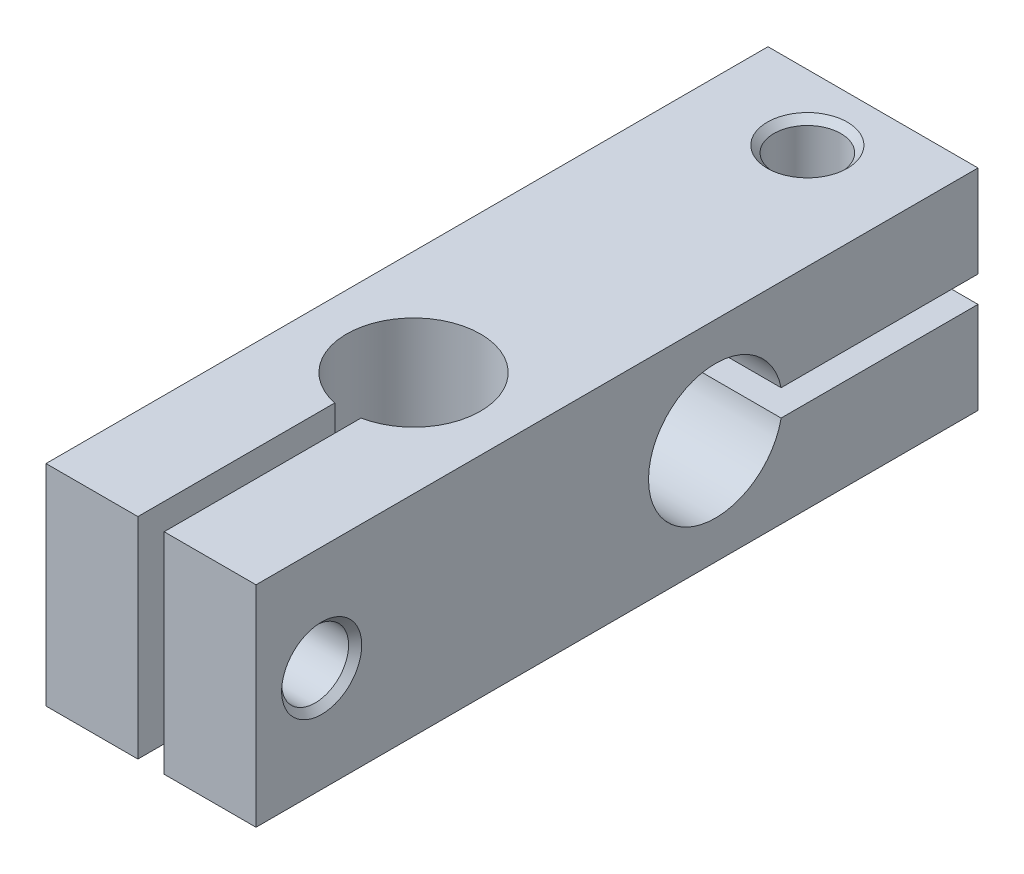
ISO-10303-21;
HEADER;
FILE_DESCRIPTION(('STEP AP214'),'2;1');
FILE_NAME('part.step','',(''),(''),'','','');
FILE_SCHEMA(('AUTOMOTIVE_DESIGN { 1 0 10303 214 1 1 1 1 }'));
ENDSEC;
DATA;
#1=APPLICATION_CONTEXT('core data for automotive mechanical design processes');
#2=APPLICATION_PROTOCOL_DEFINITION('international standard','automotive_design',2000,#1);
#3=PRODUCT_CONTEXT('',#1,'mechanical');
#4=PRODUCT('Part','Part','',(#3));
#5=PRODUCT_RELATED_PRODUCT_CATEGORY('part','',(#4));
#6=PRODUCT_DEFINITION_FORMATION('','',#4);
#7=PRODUCT_DEFINITION_CONTEXT('part definition',#1,'design');
#8=PRODUCT_DEFINITION('design','',#6,#7);
#9=PRODUCT_DEFINITION_SHAPE('','',#8);
#10=(LENGTH_UNIT() NAMED_UNIT(*) SI_UNIT(.MILLI.,.METRE.));
#11=(NAMED_UNIT(*) PLANE_ANGLE_UNIT() SI_UNIT($,.RADIAN.));
#12=(NAMED_UNIT(*) SI_UNIT($,.STERADIAN.) SOLID_ANGLE_UNIT());
#13=UNCERTAINTY_MEASURE_WITH_UNIT(LENGTH_MEASURE(1.E-05),#10,'distance_accuracy_value','');
#14=(GEOMETRIC_REPRESENTATION_CONTEXT(3) GLOBAL_UNCERTAINTY_ASSIGNED_CONTEXT((#13)) GLOBAL_UNIT_ASSIGNED_CONTEXT((#10,
#11,#12)) REPRESENTATION_CONTEXT('',''));
#15=CARTESIAN_POINT('',(0.,0.,0.));
#16=DIRECTION('',(0.,0.,1.));
#17=DIRECTION('',(1.,0.,0.));
#18=AXIS2_PLACEMENT_3D('',#15,#16,#17);
#19=CARTESIAN_POINT('',(0.,0.,0.));
#20=DIRECTION('',(0.,0.,1.));
#21=DIRECTION('',(1.,0.,0.));
#22=AXIS2_PLACEMENT_3D('',#19,#20,#21);
#23=PLANE('',#22);
#24=DIRECTION('',(0.,1.,0.));
#25=VECTOR('',#24,1.);
#26=CARTESIAN_POINT('',(8.,-8.,0.));
#27=LINE('',#26,#25);
#28=CARTESIAN_POINT('',(8.,1.,0.));
#29=VERTEX_POINT('',#28);
#30=CARTESIAN_POINT('',(8.,8.,0.));
#31=VERTEX_POINT('',#30);
#32=EDGE_CURVE('E211',#29,#31,#27,.T.);
#33=ORIENTED_EDGE('',*,*,#32,.F.);
#34=DIRECTION('',(-1.,0.,0.));
#35=VECTOR('',#34,1.);
#36=CARTESIAN_POINT('',(8.,1.,0.));
#37=LINE('',#36,#35);
#38=CARTESIAN_POINT('',(-8.,1.,0.));
#39=VERTEX_POINT('',#38);
#40=EDGE_CURVE('E148',#29,#39,#37,.T.);
#41=ORIENTED_EDGE('',*,*,#40,.T.);
#42=DIRECTION('',(0.,-1.,0.));
#43=VECTOR('',#42,1.);
#44=CARTESIAN_POINT('',(-8.,-8.,0.));
#45=LINE('',#44,#43);
#46=CARTESIAN_POINT('',(-8.,8.,0.));
#47=VERTEX_POINT('',#46);
#48=EDGE_CURVE('E206',#47,#39,#45,.T.);
#49=ORIENTED_EDGE('',*,*,#48,.F.);
#50=DIRECTION('',(-1.,0.,0.));
#51=VECTOR('',#50,1.);
#52=CARTESIAN_POINT('',(8.,8.,0.));
#53=LINE('',#52,#51);
#54=EDGE_CURVE('E195',#31,#47,#53,.T.);
#55=ORIENTED_EDGE('',*,*,#54,.F.);
#56=EDGE_LOOP('',(#33,#41,#49,#55));
#57=FACE_BOUND('',#56,.T.);
#58=ADVANCED_FACE('F36',(#57),#23,.F.);
#59=CARTESIAN_POINT('',(0.,0.,55.));
#60=DIRECTION('',(0.,0.,1.));
#61=DIRECTION('',(1.,0.,0.));
#62=AXIS2_PLACEMENT_3D('',#59,#60,#61);
#63=PLANE('',#62);
#64=DIRECTION('',(1.,0.,0.));
#65=VECTOR('',#64,1.);
#66=CARTESIAN_POINT('',(8.,-8.,55.));
#67=LINE('',#66,#65);
#68=CARTESIAN_POINT('',(-8.,-8.,55.));
#69=VERTEX_POINT('',#68);
#70=CARTESIAN_POINT('',(-0.999999999999994,-8.,55.));
#71=VERTEX_POINT('',#70);
#72=EDGE_CURVE('E196',#69,#71,#67,.T.);
#73=ORIENTED_EDGE('',*,*,#72,.T.);
#74=DIRECTION('',(0.,1.,0.));
#75=VECTOR('',#74,1.);
#76=CARTESIAN_POINT('',(-0.999999999999994,-8.,55.));
#77=LINE('',#76,#75);
#78=CARTESIAN_POINT('',(-0.999999999999997,8.,55.));
#79=VERTEX_POINT('',#78);
#80=EDGE_CURVE('E180',#71,#79,#77,.T.);
#81=ORIENTED_EDGE('',*,*,#80,.T.);
#82=DIRECTION('',(-1.,0.,0.));
#83=VECTOR('',#82,1.);
#84=CARTESIAN_POINT('',(8.,8.,55.));
#85=LINE('',#84,#83);
#86=CARTESIAN_POINT('',(-8.,8.,55.));
#87=VERTEX_POINT('',#86);
#88=EDGE_CURVE('E201',#79,#87,#85,.T.);
#89=ORIENTED_EDGE('',*,*,#88,.T.);
#90=DIRECTION('',(0.,-1.,0.));
#91=VECTOR('',#90,1.);
#92=CARTESIAN_POINT('',(-8.,-8.,55.));
#93=LINE('',#92,#91);
#94=EDGE_CURVE('E191',#87,#69,#93,.T.);
#95=ORIENTED_EDGE('',*,*,#94,.T.);
#96=EDGE_LOOP('',(#73,#81,#89,#95));
#97=FACE_BOUND('',#96,.T.);
#98=ADVANCED_FACE('F239',(#97),#63,.T.);
#99=CARTESIAN_POINT('',(-8.,-8.,55.));
#100=DIRECTION('',(1.,0.,0.));
#101=DIRECTION('',(0.,0.,-1.));
#102=AXIS2_PLACEMENT_3D('',#99,#100,#101);
#103=PLANE('',#102);
#104=CARTESIAN_POINT('',(-8.,0.,50.));
#105=DIRECTION('',(-1.,0.,0.));
#106=DIRECTION('',(0.,0.,1.));
#107=AXIS2_PLACEMENT_3D('',#104,#105,#106);
#108=CIRCLE('',#107,2.1);
#109=CARTESIAN_POINT('',(-8.,0.,52.1));
#110=VERTEX_POINT('',#109);
#111=EDGE_CURVE('E160',#110,#110,#108,.T.);
#112=ORIENTED_EDGE('',*,*,#111,.F.);
#113=EDGE_LOOP('',(#112));
#114=FACE_BOUND('',#113,.T.);
#115=DIRECTION('',(0.,0.,-1.));
#116=VECTOR('',#115,1.);
#117=CARTESIAN_POINT('',(-8.,1.,0.));
#118=LINE('',#117,#116);
#119=CARTESIAN_POINT('',(-8.,0.999999999999999,14.99900009998));
#120=VERTEX_POINT('',#119);
#121=EDGE_CURVE('E140',#120,#39,#118,.T.);
#122=ORIENTED_EDGE('',*,*,#121,.F.);
#123=CARTESIAN_POINT('',(-8.,0.,20.));
#124=DIRECTION('',(-1.,0.,0.));
#125=DIRECTION('',(0.,0.,1.));
#126=AXIS2_PLACEMENT_3D('',#123,#124,#125);
#127=CIRCLE('',#126,5.09999999999999);
#128=CARTESIAN_POINT('',(-8.,-1.,14.99900009998));
#129=VERTEX_POINT('',#128);
#130=EDGE_CURVE('E132',#129,#120,#127,.T.);
#131=ORIENTED_EDGE('',*,*,#130,.F.);
#132=DIRECTION('',(0.,0.,1.));
#133=VECTOR('',#132,1.);
#134=CARTESIAN_POINT('',(-8.,-1.,0.));
#135=LINE('',#134,#133);
#136=CARTESIAN_POINT('',(-8.,-1.,0.));
#137=VERTEX_POINT('',#136);
#138=EDGE_CURVE('E131',#137,#129,#135,.T.);
#139=ORIENTED_EDGE('',*,*,#138,.F.);
#140=CARTESIAN_POINT('',(-8.,-8.,0.));
#141=VERTEX_POINT('',#140);
#142=EDGE_CURVE('E188',#137,#141,#45,.T.);
#143=ORIENTED_EDGE('',*,*,#142,.T.);
#144=DIRECTION('',(0.,0.,-1.));
#145=VECTOR('',#144,1.);
#146=CARTESIAN_POINT('',(-8.,-8.,55.));
#147=LINE('',#146,#145);
#148=EDGE_CURVE('E221',#69,#141,#147,.T.);
#149=ORIENTED_EDGE('',*,*,#148,.F.);
#150=ORIENTED_EDGE('',*,*,#94,.F.);
#151=DIRECTION('',(0.,0.,-1.));
#152=VECTOR('',#151,1.);
#153=CARTESIAN_POINT('',(-8.,8.,55.));
#154=LINE('',#153,#152);
#155=EDGE_CURVE('E205',#87,#47,#154,.T.);
#156=ORIENTED_EDGE('',*,*,#155,.T.);
#157=ORIENTED_EDGE('',*,*,#48,.T.);
#158=EDGE_LOOP('',(#122,#131,#139,#143,#149,#150,#156,#157));
#159=FACE_BOUND('',#158,.T.);
#160=ADVANCED_FACE('F38',(#114,#159),#103,.F.);
#161=CARTESIAN_POINT('',(8.,-8.,55.));
#162=DIRECTION('',(0.,1.,0.));
#163=DIRECTION('',(-1.,0.,0.));
#164=AXIS2_PLACEMENT_3D('',#161,#162,#163);
#165=PLANE('',#164);
#166=CARTESIAN_POINT('',(0.,-8.,5.));
#167=DIRECTION('',(0.,-1.,0.));
#168=DIRECTION('',(0.,0.,-1.));
#169=AXIS2_PLACEMENT_3D('',#166,#167,#168);
#170=CIRCLE('',#169,2.09999999999999);
#171=CARTESIAN_POINT('',(0.,-8.,2.90000000000001));
#172=VERTEX_POINT('',#171);
#173=EDGE_CURVE('E268',#172,#172,#170,.T.);
#174=ORIENTED_EDGE('',*,*,#173,.F.);
#175=EDGE_LOOP('',(#174));
#176=FACE_BOUND('',#175,.T.);
#177=DIRECTION('',(0.,0.,-1.));
#178=VECTOR('',#177,1.);
#179=CARTESIAN_POINT('',(1.00000000000001,-8.,0.));
#180=LINE('',#179,#178);
#181=CARTESIAN_POINT('',(1.00000000000001,-8.,55.));
#182=VERTEX_POINT('',#181);
#183=CARTESIAN_POINT('',(1.00000000000001,-8.,40.00099990002));
#184=VERTEX_POINT('',#183);
#185=EDGE_CURVE('E176',#182,#184,#180,.T.);
#186=ORIENTED_EDGE('',*,*,#185,.T.);
#187=CARTESIAN_POINT('',(0.,-8.,35.));
#188=DIRECTION('',(0.,1.,0.));
#189=DIRECTION('',(0.,0.,1.));
#190=AXIS2_PLACEMENT_3D('',#187,#188,#189);
#191=CIRCLE('',#190,5.1);
#192=CARTESIAN_POINT('',(-0.999999999999998,-8.,40.00099990002));
#193=VERTEX_POINT('',#192);
#194=EDGE_CURVE('E154',#184,#193,#191,.T.);
#195=ORIENTED_EDGE('',*,*,#194,.T.);
#196=DIRECTION('',(0.,0.,-1.));
#197=VECTOR('',#196,1.);
#198=CARTESIAN_POINT('',(-1.00000000000001,-8.,0.));
#199=LINE('',#198,#197);
#200=EDGE_CURVE('E173',#71,#193,#199,.T.);
#201=ORIENTED_EDGE('',*,*,#200,.F.);
#202=ORIENTED_EDGE('',*,*,#72,.F.);
#203=ORIENTED_EDGE('',*,*,#148,.T.);
#204=DIRECTION('',(1.,0.,0.));
#205=VECTOR('',#204,1.);
#206=CARTESIAN_POINT('',(8.,-8.,0.));
#207=LINE('',#206,#205);
#208=CARTESIAN_POINT('',(8.,-8.,0.));
#209=VERTEX_POINT('',#208);
#210=EDGE_CURVE('E209',#141,#209,#207,.T.);
#211=ORIENTED_EDGE('',*,*,#210,.T.);
#212=DIRECTION('',(0.,0.,-1.));
#213=VECTOR('',#212,1.);
#214=CARTESIAN_POINT('',(8.,-8.,55.));
#215=LINE('',#214,#213);
#216=CARTESIAN_POINT('',(8.,-8.,55.));
#217=VERTEX_POINT('',#216);
#218=EDGE_CURVE('E219',#217,#209,#215,.T.);
#219=ORIENTED_EDGE('',*,*,#218,.F.);
#220=EDGE_CURVE('E194',#182,#217,#67,.T.);
#221=ORIENTED_EDGE('',*,*,#220,.F.);
#222=EDGE_LOOP('',(#186,#195,#201,#202,#203,#211,#219,#221));
#223=FACE_BOUND('',#222,.T.);
#224=ADVANCED_FACE('F233',(#176,#223),#165,.F.);
#225=CARTESIAN_POINT('',(8.,-8.,55.));
#226=DIRECTION('',(-1.,0.,0.));
#227=DIRECTION('',(0.,0.,1.));
#228=AXIS2_PLACEMENT_3D('',#225,#226,#227);
#229=PLANE('',#228);
#230=CARTESIAN_POINT('',(8.,0.,50.));
#231=DIRECTION('',(1.,0.,0.));
#232=DIRECTION('',(0.,0.,-1.));
#233=AXIS2_PLACEMENT_3D('',#230,#231,#232);
#234=CIRCLE('',#233,3.05);
#235=CARTESIAN_POINT('',(8.,0.,46.95));
#236=VERTEX_POINT('',#235);
#237=EDGE_CURVE('E166',#236,#236,#234,.T.);
#238=ORIENTED_EDGE('',*,*,#237,.F.);
#239=EDGE_LOOP('',(#238));
#240=FACE_BOUND('',#239,.T.);
#241=DIRECTION('',(0.,0.,1.));
#242=VECTOR('',#241,1.);
#243=CARTESIAN_POINT('',(8.,-1.,0.));
#244=LINE('',#243,#242);
#245=CARTESIAN_POINT('',(8.,-1.,0.));
#246=VERTEX_POINT('',#245);
#247=CARTESIAN_POINT('',(8.,-1.,14.99900009998));
#248=VERTEX_POINT('',#247);
#249=EDGE_CURVE('E59',#246,#248,#244,.T.);
#250=ORIENTED_EDGE('',*,*,#249,.T.);
#251=CARTESIAN_POINT('',(8.,0.,20.));
#252=DIRECTION('',(-1.,0.,0.));
#253=DIRECTION('',(0.,0.,1.));
#254=AXIS2_PLACEMENT_3D('',#251,#252,#253);
#255=CIRCLE('',#254,5.09999999999999);
#256=CARTESIAN_POINT('',(8.,1.,14.99900009998));
#257=VERTEX_POINT('',#256);
#258=EDGE_CURVE('E11',#248,#257,#255,.T.);
#259=ORIENTED_EDGE('',*,*,#258,.T.);
#260=DIRECTION('',(0.,0.,-1.));
#261=VECTOR('',#260,1.);
#262=CARTESIAN_POINT('',(8.,1.,0.));
#263=LINE('',#262,#261);
#264=EDGE_CURVE('E139',#257,#29,#263,.T.);
#265=ORIENTED_EDGE('',*,*,#264,.T.);
#266=ORIENTED_EDGE('',*,*,#32,.T.);
#267=DIRECTION('',(0.,0.,-1.));
#268=VECTOR('',#267,1.);
#269=CARTESIAN_POINT('',(8.,8.,55.));
#270=LINE('',#269,#268);
#271=CARTESIAN_POINT('',(8.,8.,55.));
#272=VERTEX_POINT('',#271);
#273=EDGE_CURVE('E216',#272,#31,#270,.T.);
#274=ORIENTED_EDGE('',*,*,#273,.F.);
#275=DIRECTION('',(0.,1.,0.));
#276=VECTOR('',#275,1.);
#277=CARTESIAN_POINT('',(8.,-8.,55.));
#278=LINE('',#277,#276);
#279=EDGE_CURVE('E199',#217,#272,#278,.T.);
#280=ORIENTED_EDGE('',*,*,#279,.F.);
#281=ORIENTED_EDGE('',*,*,#218,.T.);
#282=EDGE_CURVE('E138',#209,#246,#27,.T.);
#283=ORIENTED_EDGE('',*,*,#282,.T.);
#284=EDGE_LOOP('',(#250,#259,#265,#266,#274,#280,#281,#283));
#285=FACE_BOUND('',#284,.T.);
#286=ADVANCED_FACE('F135',(#240,#285),#229,.F.);
#287=CARTESIAN_POINT('',(8.,8.,55.));
#288=DIRECTION('',(0.,-1.,0.));
#289=DIRECTION('',(1.,0.,0.));
#290=AXIS2_PLACEMENT_3D('',#287,#288,#289);
#291=PLANE('',#290);
#292=CARTESIAN_POINT('',(0.,8.,5.));
#293=DIRECTION('',(0.,1.,0.));
#294=DIRECTION('',(0.,0.,1.));
#295=AXIS2_PLACEMENT_3D('',#292,#293,#294);
#296=CIRCLE('',#295,3.05);
#297=CARTESIAN_POINT('',(0.,8.,8.05));
#298=VERTEX_POINT('',#297);
#299=EDGE_CURVE('E262',#298,#298,#296,.T.);
#300=ORIENTED_EDGE('',*,*,#299,.F.);
#301=EDGE_LOOP('',(#300));
#302=FACE_BOUND('',#301,.T.);
#303=DIRECTION('',(0.,0.,-1.));
#304=VECTOR('',#303,1.);
#305=CARTESIAN_POINT('',(-1.00000000000001,8.,0.));
#306=LINE('',#305,#304);
#307=CARTESIAN_POINT('',(-0.999999999999997,8.,40.00099990002));
#308=VERTEX_POINT('',#307);
#309=EDGE_CURVE('E181',#79,#308,#306,.T.);
#310=ORIENTED_EDGE('',*,*,#309,.T.);
#311=CARTESIAN_POINT('',(0.,8.,35.));
#312=DIRECTION('',(0.,1.,0.));
#313=DIRECTION('',(0.,0.,1.));
#314=AXIS2_PLACEMENT_3D('',#311,#312,#313);
#315=CIRCLE('',#314,5.09999999999999);
#316=CARTESIAN_POINT('',(1.00000000000001,8.,40.00099990002));
#317=VERTEX_POINT('',#316);
#318=EDGE_CURVE('E151',#317,#308,#315,.T.);
#319=ORIENTED_EDGE('',*,*,#318,.F.);
#320=DIRECTION('',(0.,0.,-1.));
#321=VECTOR('',#320,1.);
#322=CARTESIAN_POINT('',(1.00000000000001,8.,0.));
#323=LINE('',#322,#321);
#324=CARTESIAN_POINT('',(1.00000000000001,8.,55.));
#325=VERTEX_POINT('',#324);
#326=EDGE_CURVE('E177',#325,#317,#323,.T.);
#327=ORIENTED_EDGE('',*,*,#326,.F.);
#328=EDGE_CURVE('E202',#272,#325,#85,.T.);
#329=ORIENTED_EDGE('',*,*,#328,.F.);
#330=ORIENTED_EDGE('',*,*,#273,.T.);
#331=ORIENTED_EDGE('',*,*,#54,.T.);
#332=ORIENTED_EDGE('',*,*,#155,.F.);
#333=ORIENTED_EDGE('',*,*,#88,.F.);
#334=EDGE_LOOP('',(#310,#319,#327,#329,#330,#331,#332,#333));
#335=FACE_BOUND('',#334,.T.);
#336=ADVANCED_FACE('F242',(#302,#335),#291,.F.);
#337=DIRECTION('',(0.,1.,0.));
#338=VECTOR('',#337,1.);
#339=CARTESIAN_POINT('',(1.00000000000001,-8.,55.));
#340=LINE('',#339,#338);
#341=EDGE_CURVE('E186',#182,#325,#340,.T.);
#342=ORIENTED_EDGE('',*,*,#341,.F.);
#343=ORIENTED_EDGE('',*,*,#220,.T.);
#344=ORIENTED_EDGE('',*,*,#279,.T.);
#345=ORIENTED_EDGE('',*,*,#328,.T.);
#346=EDGE_LOOP('',(#342,#343,#344,#345));
#347=FACE_BOUND('',#346,.T.);
#348=ADVANCED_FACE('F290',(#347),#63,.T.);
#349=ORIENTED_EDGE('',*,*,#142,.F.);
#350=DIRECTION('',(-1.,0.,0.));
#351=VECTOR('',#350,1.);
#352=CARTESIAN_POINT('',(8.,-1.,0.));
#353=LINE('',#352,#351);
#354=EDGE_CURVE('E142',#246,#137,#353,.T.);
#355=ORIENTED_EDGE('',*,*,#354,.F.);
#356=ORIENTED_EDGE('',*,*,#282,.F.);
#357=ORIENTED_EDGE('',*,*,#210,.F.);
#358=EDGE_LOOP('',(#349,#355,#356,#357));
#359=FACE_BOUND('',#358,.T.);
#360=ADVANCED_FACE('F255',(#359),#23,.F.);
#361=CARTESIAN_POINT('',(1.00000000000001,-8.,0.));
#362=DIRECTION('',(1.,0.,0.));
#363=DIRECTION('',(0.,1.,0.));
#364=AXIS2_PLACEMENT_3D('',#361,#362,#363);
#365=PLANE('',#364);
#366=CARTESIAN_POINT('',(1.00000000000001,0.,50.));
#367=DIRECTION('',(1.,0.,0.));
#368=DIRECTION('',(0.,1.,0.));
#369=AXIS2_PLACEMENT_3D('',#366,#367,#368);
#370=CIRCLE('',#369,2.54999999999999);
#371=CARTESIAN_POINT('',(1.00000000000001,2.54999999999999,50.));
#372=VERTEX_POINT('',#371);
#373=EDGE_CURVE('E172',#372,#372,#370,.T.);
#374=ORIENTED_EDGE('',*,*,#373,.T.);
#375=EDGE_LOOP('',(#374));
#376=FACE_BOUND('',#375,.T.);
#377=ORIENTED_EDGE('',*,*,#326,.T.);
#378=DIRECTION('',(0.,1.,0.));
#379=VECTOR('',#378,1.);
#380=CARTESIAN_POINT('',(1.00000000000001,8.,40.00099990002));
#381=LINE('',#380,#379);
#382=EDGE_CURVE('E157',#317,#184,#381,.F.);
#383=ORIENTED_EDGE('',*,*,#382,.T.);
#384=ORIENTED_EDGE('',*,*,#185,.F.);
#385=ORIENTED_EDGE('',*,*,#341,.T.);
#386=EDGE_LOOP('',(#377,#383,#384,#385));
#387=FACE_BOUND('',#386,.T.);
#388=ADVANCED_FACE('F294',(#376,#387),#365,.F.);
#389=CARTESIAN_POINT('',(-1.00000000000001,-8.,0.));
#390=DIRECTION('',(1.,0.,0.));
#391=DIRECTION('',(0.,0.,-1.));
#392=AXIS2_PLACEMENT_3D('',#389,#390,#391);
#393=PLANE('',#392);
#394=DIRECTION('',(0.,1.,0.));
#395=VECTOR('',#394,1.);
#396=CARTESIAN_POINT('',(-0.999999999999997,8.,40.00099990002));
#397=LINE('',#396,#395);
#398=EDGE_CURVE('E45',#308,#193,#397,.F.);
#399=ORIENTED_EDGE('',*,*,#398,.F.);
#400=ORIENTED_EDGE('',*,*,#309,.F.);
#401=ORIENTED_EDGE('',*,*,#80,.F.);
#402=ORIENTED_EDGE('',*,*,#200,.T.);
#403=EDGE_LOOP('',(#399,#400,#401,#402));
#404=FACE_BOUND('',#403,.T.);
#405=CARTESIAN_POINT('',(-0.999999999999993,0.,50.));
#406=DIRECTION('',(1.,0.,0.));
#407=DIRECTION('',(0.,0.,-1.));
#408=AXIS2_PLACEMENT_3D('',#405,#406,#407);
#409=CIRCLE('',#408,2.1);
#410=CARTESIAN_POINT('',(-0.999999999999994,0.,47.9));
#411=VERTEX_POINT('',#410);
#412=EDGE_CURVE('E163',#411,#411,#409,.T.);
#413=ORIENTED_EDGE('',*,*,#412,.F.);
#414=EDGE_LOOP('',(#413));
#415=FACE_BOUND('',#414,.T.);
#416=ADVANCED_FACE('F235',(#404,#415),#393,.T.);
#417=CARTESIAN_POINT('',(8.,0.,50.));
#418=DIRECTION('',(1.,0.,0.));
#419=DIRECTION('',(0.,0.,-1.));
#420=AXIS2_PLACEMENT_3D('',#417,#418,#419);
#421=CYLINDRICAL_SURFACE('',#420,2.54999999999999);
#422=CARTESIAN_POINT('',(7.5,0.,50.));
#423=DIRECTION('',(1.,0.,0.));
#424=DIRECTION('',(0.,0.,-1.));
#425=AXIS2_PLACEMENT_3D('',#422,#423,#424);
#426=CIRCLE('',#425,2.55);
#427=CARTESIAN_POINT('',(7.5,0.,47.45));
#428=VERTEX_POINT('',#427);
#429=EDGE_CURVE('E169',#428,#428,#426,.T.);
#430=ORIENTED_EDGE('',*,*,#429,.T.);
#431=EDGE_LOOP('',(#430));
#432=FACE_BOUND('',#431,.T.);
#433=ORIENTED_EDGE('',*,*,#373,.F.);
#434=EDGE_LOOP('',(#433));
#435=FACE_BOUND('',#434,.T.);
#436=ADVANCED_FACE('F309',(#432,#435),#421,.F.);
#437=CARTESIAN_POINT('',(8.,0.,50.));
#438=DIRECTION('',(1.,0.,0.));
#439=DIRECTION('',(0.,0.,-1.));
#440=AXIS2_PLACEMENT_3D('',#437,#438,#439);
#441=CONICAL_SURFACE('',#440,3.05,0.78539816339745);
#442=ORIENTED_EDGE('',*,*,#429,.F.);
#443=EDGE_LOOP('',(#442));
#444=FACE_BOUND('',#443,.T.);
#445=ORIENTED_EDGE('',*,*,#237,.T.);
#446=EDGE_LOOP('',(#445));
#447=FACE_BOUND('',#446,.T.);
#448=ADVANCED_FACE('F313',(#444,#447),#441,.F.);
#449=CARTESIAN_POINT('',(-8.,0.,50.));
#450=DIRECTION('',(-1.,0.,0.));
#451=DIRECTION('',(0.,0.,1.));
#452=AXIS2_PLACEMENT_3D('',#449,#450,#451);
#453=CYLINDRICAL_SURFACE('',#452,2.1);
#454=ORIENTED_EDGE('',*,*,#412,.T.);
#455=EDGE_LOOP('',(#454));
#456=FACE_BOUND('',#455,.T.);
#457=ORIENTED_EDGE('',*,*,#111,.T.);
#458=EDGE_LOOP('',(#457));
#459=FACE_BOUND('',#458,.T.);
#460=ADVANCED_FACE('F317',(#456,#459),#453,.F.);
#461=CARTESIAN_POINT('',(0.,8.,35.));
#462=DIRECTION('',(0.,1.,0.));
#463=DIRECTION('',(0.,0.,1.));
#464=AXIS2_PLACEMENT_3D('',#461,#462,#463);
#465=CYLINDRICAL_SURFACE('',#464,5.09999999999999);
#466=ORIENTED_EDGE('',*,*,#318,.T.);
#467=ORIENTED_EDGE('',*,*,#398,.T.);
#468=ORIENTED_EDGE('',*,*,#194,.F.);
#469=ORIENTED_EDGE('',*,*,#382,.F.);
#470=EDGE_LOOP('',(#466,#467,#468,#469));
#471=FACE_BOUND('',#470,.T.);
#472=ADVANCED_FACE('F228',(#471),#465,.F.);
#473=CARTESIAN_POINT('',(8.,1.,0.));
#474=DIRECTION('',(0.,1.,0.));
#475=DIRECTION('',(0.,0.,1.));
#476=AXIS2_PLACEMENT_3D('',#473,#474,#475);
#477=PLANE('',#476);
#478=CARTESIAN_POINT('',(0.,1.,5.));
#479=DIRECTION('',(0.,1.,0.));
#480=DIRECTION('',(0.,0.,1.));
#481=AXIS2_PLACEMENT_3D('',#478,#479,#480);
#482=CIRCLE('',#481,2.54999999999999);
#483=CARTESIAN_POINT('',(0.,1.,7.54999999999999));
#484=VERTEX_POINT('',#483);
#485=EDGE_CURVE('E40',#484,#484,#482,.T.);
#486=ORIENTED_EDGE('',*,*,#485,.T.);
#487=EDGE_LOOP('',(#486));
#488=FACE_BOUND('',#487,.T.);
#489=ORIENTED_EDGE('',*,*,#264,.F.);
#490=DIRECTION('',(-1.,0.,0.));
#491=VECTOR('',#490,1.);
#492=CARTESIAN_POINT('',(-8.,1.,14.99900009998));
#493=LINE('',#492,#491);
#494=EDGE_CURVE('E52',#257,#120,#493,.T.);
#495=ORIENTED_EDGE('',*,*,#494,.T.);
#496=ORIENTED_EDGE('',*,*,#121,.T.);
#497=ORIENTED_EDGE('',*,*,#40,.F.);
#498=EDGE_LOOP('',(#489,#495,#496,#497));
#499=FACE_BOUND('',#498,.T.);
#500=ADVANCED_FACE('F324',(#488,#499),#477,.F.);
#501=CARTESIAN_POINT('',(8.,-1.,0.));
#502=DIRECTION('',(0.,-1.,0.));
#503=DIRECTION('',(0.,0.,-1.));
#504=AXIS2_PLACEMENT_3D('',#501,#502,#503);
#505=PLANE('',#504);
#506=CARTESIAN_POINT('',(0.,-1.,5.));
#507=DIRECTION('',(0.,-1.,0.));
#508=DIRECTION('',(0.,0.,-1.));
#509=AXIS2_PLACEMENT_3D('',#506,#507,#508);
#510=CIRCLE('',#509,2.09999999999999);
#511=CARTESIAN_POINT('',(0.,-1.,2.90000000000001));
#512=VERTEX_POINT('',#511);
#513=EDGE_CURVE('E265',#512,#512,#510,.T.);
#514=ORIENTED_EDGE('',*,*,#513,.T.);
#515=EDGE_LOOP('',(#514));
#516=FACE_BOUND('',#515,.T.);
#517=ORIENTED_EDGE('',*,*,#138,.T.);
#518=DIRECTION('',(-1.,0.,0.));
#519=VECTOR('',#518,1.);
#520=CARTESIAN_POINT('',(-8.,-1.,14.99900009998));
#521=LINE('',#520,#519);
#522=EDGE_CURVE('E124',#129,#248,#521,.F.);
#523=ORIENTED_EDGE('',*,*,#522,.T.);
#524=ORIENTED_EDGE('',*,*,#249,.F.);
#525=ORIENTED_EDGE('',*,*,#354,.T.);
#526=EDGE_LOOP('',(#517,#523,#524,#525));
#527=FACE_BOUND('',#526,.T.);
#528=ADVANCED_FACE('F129',(#516,#527),#505,.F.);
#529=CARTESIAN_POINT('',(-8.,0.,20.));
#530=DIRECTION('',(-1.,0.,0.));
#531=DIRECTION('',(0.,0.,1.));
#532=AXIS2_PLACEMENT_3D('',#529,#530,#531);
#533=CYLINDRICAL_SURFACE('',#532,5.09999999999999);
#534=ORIENTED_EDGE('',*,*,#258,.F.);
#535=ORIENTED_EDGE('',*,*,#522,.F.);
#536=ORIENTED_EDGE('',*,*,#130,.T.);
#537=ORIENTED_EDGE('',*,*,#494,.F.);
#538=EDGE_LOOP('',(#534,#535,#536,#537));
#539=FACE_BOUND('',#538,.T.);
#540=ADVANCED_FACE('F123',(#539),#533,.F.);
#541=CARTESIAN_POINT('',(0.,8.,5.));
#542=DIRECTION('',(0.,1.,0.));
#543=DIRECTION('',(0.,0.,1.));
#544=AXIS2_PLACEMENT_3D('',#541,#542,#543);
#545=CYLINDRICAL_SURFACE('',#544,2.54999999999999);
#546=CARTESIAN_POINT('',(0.,7.5,5.));
#547=DIRECTION('',(0.,1.,0.));
#548=DIRECTION('',(0.,0.,1.));
#549=AXIS2_PLACEMENT_3D('',#546,#547,#548);
#550=CIRCLE('',#549,2.55);
#551=CARTESIAN_POINT('',(0.,7.5,7.55));
#552=VERTEX_POINT('',#551);
#553=EDGE_CURVE('E258',#552,#552,#550,.T.);
#554=ORIENTED_EDGE('',*,*,#553,.T.);
#555=EDGE_LOOP('',(#554));
#556=FACE_BOUND('',#555,.T.);
#557=ORIENTED_EDGE('',*,*,#485,.F.);
#558=EDGE_LOOP('',(#557));
#559=FACE_BOUND('',#558,.T.);
#560=ADVANCED_FACE('F333',(#556,#559),#545,.F.);
#561=CARTESIAN_POINT('',(0.,8.,5.));
#562=DIRECTION('',(0.,1.,0.));
#563=DIRECTION('',(0.,0.,1.));
#564=AXIS2_PLACEMENT_3D('',#561,#562,#563);
#565=CONICAL_SURFACE('',#564,3.05,0.78539816339745);
#566=ORIENTED_EDGE('',*,*,#553,.F.);
#567=EDGE_LOOP('',(#566));
#568=FACE_BOUND('',#567,.T.);
#569=ORIENTED_EDGE('',*,*,#299,.T.);
#570=EDGE_LOOP('',(#569));
#571=FACE_BOUND('',#570,.T.);
#572=ADVANCED_FACE('F336',(#568,#571),#565,.F.);
#573=CARTESIAN_POINT('',(0.,-8.,5.));
#574=DIRECTION('',(0.,-1.,0.));
#575=DIRECTION('',(0.,0.,-1.));
#576=AXIS2_PLACEMENT_3D('',#573,#574,#575);
#577=CYLINDRICAL_SURFACE('',#576,2.09999999999999);
#578=ORIENTED_EDGE('',*,*,#173,.T.);
#579=EDGE_LOOP('',(#578));
#580=FACE_BOUND('',#579,.T.);
#581=ORIENTED_EDGE('',*,*,#513,.F.);
#582=EDGE_LOOP('',(#581));
#583=FACE_BOUND('',#582,.T.);
#584=ADVANCED_FACE('F272',(#580,#583),#577,.F.);
#585=CLOSED_SHELL('',(#58,#98,#160,#224,#286,#336,#348,#360,#388,#416,#436,#448,#460,#472,#500,
#528,#540,#560,#572,#584));
#586=MANIFOLD_SOLID_BREP('B2',#585);
#587=ADVANCED_BREP_SHAPE_REPRESENTATION('',(#18,#586),#14);
#588=SHAPE_DEFINITION_REPRESENTATION(#9,#587);
ENDSEC;
END-ISO-10303-21;
